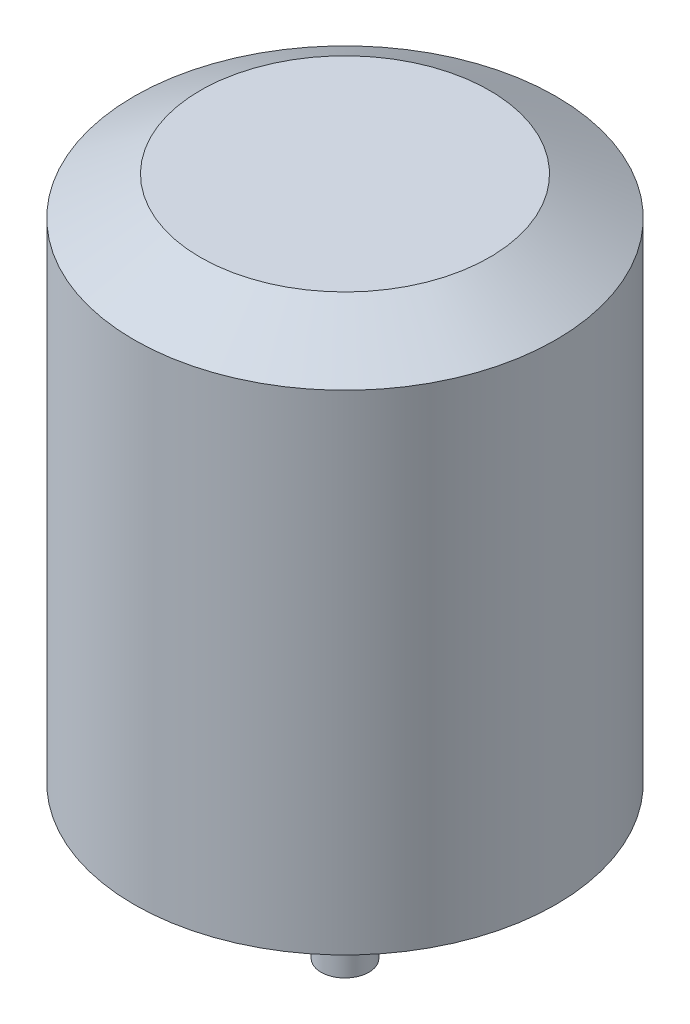
ISO-10303-21;
HEADER;
FILE_DESCRIPTION(('STEP AP214'),'2;1');
FILE_NAME('part.step','',(''),(''),'','','');
FILE_SCHEMA(('AUTOMOTIVE_DESIGN { 1 0 10303 214 1 1 1 1 }'));
ENDSEC;
DATA;
#1=APPLICATION_CONTEXT('core data for automotive mechanical design processes');
#2=APPLICATION_PROTOCOL_DEFINITION('international standard','automotive_design',2000,#1);
#3=PRODUCT_CONTEXT('',#1,'mechanical');
#4=PRODUCT('Part','Part','',(#3));
#5=PRODUCT_RELATED_PRODUCT_CATEGORY('part','',(#4));
#6=PRODUCT_DEFINITION_FORMATION('','',#4);
#7=PRODUCT_DEFINITION_CONTEXT('part definition',#1,'design');
#8=PRODUCT_DEFINITION('design','',#6,#7);
#9=PRODUCT_DEFINITION_SHAPE('','',#8);
#10=(LENGTH_UNIT() NAMED_UNIT(*) SI_UNIT(.MILLI.,.METRE.));
#11=(NAMED_UNIT(*) PLANE_ANGLE_UNIT() SI_UNIT($,.RADIAN.));
#12=(NAMED_UNIT(*) SI_UNIT($,.STERADIAN.) SOLID_ANGLE_UNIT());
#13=UNCERTAINTY_MEASURE_WITH_UNIT(LENGTH_MEASURE(1.E-05),#10,'distance_accuracy_value','');
#14=(GEOMETRIC_REPRESENTATION_CONTEXT(3) GLOBAL_UNCERTAINTY_ASSIGNED_CONTEXT((#13)) GLOBAL_UNIT_ASSIGNED_CONTEXT((#10,
#11,#12)) REPRESENTATION_CONTEXT('',''));
#15=CARTESIAN_POINT('',(0.,0.,0.));
#16=DIRECTION('',(0.,0.,1.));
#17=DIRECTION('',(1.,0.,0.));
#18=AXIS2_PLACEMENT_3D('',#15,#16,#17);
#19=CARTESIAN_POINT('',(0.,17.5,0.));
#20=DIRECTION('',(0.,-1.,0.));
#21=DIRECTION('',(0.,0.,-1.));
#22=AXIS2_PLACEMENT_3D('',#19,#20,#21);
#23=CYLINDRICAL_SURFACE('',#22,14.);
#24=CARTESIAN_POINT('',(0.,14.96,0.));
#25=DIRECTION('',(0.,1.,0.));
#26=DIRECTION('',(0.,0.,1.));
#27=AXIS2_PLACEMENT_3D('',#24,#25,#26);
#28=CIRCLE('',#27,14.);
#29=CARTESIAN_POINT('',(0.,14.96,14.));
#30=VERTEX_POINT('',#29);
#31=EDGE_CURVE('E46',#30,#30,#28,.F.);
#32=ORIENTED_EDGE('',*,*,#31,.T.);
#33=EDGE_LOOP('',(#32));
#34=FACE_BOUND('',#33,.T.);
#35=CARTESIAN_POINT('',(0.,-17.5,0.));
#36=DIRECTION('',(0.,1.,0.));
#37=DIRECTION('',(0.,0.,1.));
#38=AXIS2_PLACEMENT_3D('',#35,#36,#37);
#39=CIRCLE('',#38,14.);
#40=CARTESIAN_POINT('',(0.,-17.5,14.));
#41=VERTEX_POINT('',#40);
#42=EDGE_CURVE('E54',#41,#41,#39,.T.);
#43=ORIENTED_EDGE('',*,*,#42,.T.);
#44=EDGE_LOOP('',(#43));
#45=FACE_BOUND('',#44,.T.);
#46=ADVANCED_FACE('F38',(#34,#45),#23,.T.);
#47=CARTESIAN_POINT('',(0.,17.5,0.));
#48=DIRECTION('',(0.,1.,0.));
#49=DIRECTION('',(0.,0.,1.));
#50=AXIS2_PLACEMENT_3D('',#47,#48,#49);
#51=PLANE('',#50);
#52=CARTESIAN_POINT('',(0.,17.5,0.));
#53=DIRECTION('',(0.,1.,0.));
#54=DIRECTION('',(0.,0.,1.));
#55=AXIS2_PLACEMENT_3D('',#52,#53,#54);
#56=CIRCLE('',#55,9.60059094877507);
#57=CARTESIAN_POINT('',(0.,17.5,9.60059094877507));
#58=VERTEX_POINT('',#57);
#59=EDGE_CURVE('E50',#58,#58,#56,.T.);
#60=ORIENTED_EDGE('',*,*,#59,.T.);
#61=EDGE_LOOP('',(#60));
#62=FACE_BOUND('',#61,.T.);
#63=ADVANCED_FACE('F73',(#62),#51,.T.);
#64=CARTESIAN_POINT('',(0.,-17.5,0.));
#65=DIRECTION('',(0.,1.,0.));
#66=DIRECTION('',(0.,0.,1.));
#67=AXIS2_PLACEMENT_3D('',#64,#65,#66);
#68=PLANE('',#67);
#69=CARTESIAN_POINT('',(0.,-17.5,0.));
#70=DIRECTION('',(0.,1.,0.));
#71=DIRECTION('',(0.,0.,1.));
#72=AXIS2_PLACEMENT_3D('',#69,#70,#71);
#73=CIRCLE('',#72,1.5875);
#74=CARTESIAN_POINT('',(0.,-17.5,1.5875));
#75=VERTEX_POINT('',#74);
#76=EDGE_CURVE('E11',#75,#75,#73,.F.);
#77=ORIENTED_EDGE('',*,*,#76,.F.);
#78=EDGE_LOOP('',(#77));
#79=FACE_BOUND('',#78,.T.);
#80=ORIENTED_EDGE('',*,*,#42,.F.);
#81=EDGE_LOOP('',(#80));
#82=FACE_BOUND('',#81,.T.);
#83=ADVANCED_FACE('F77',(#79,#82),#68,.F.);
#84=CARTESIAN_POINT('',(0.,17.5,0.));
#85=DIRECTION('',(0.,-1.,0.));
#86=DIRECTION('',(0.,0.,-1.));
#87=AXIS2_PLACEMENT_3D('',#84,#85,#86);
#88=CONICAL_SURFACE('',#87,9.60059094877507,1.0471975511966);
#89=ORIENTED_EDGE('',*,*,#31,.F.);
#90=EDGE_LOOP('',(#89));
#91=FACE_BOUND('',#90,.T.);
#92=ORIENTED_EDGE('',*,*,#59,.F.);
#93=EDGE_LOOP('',(#92));
#94=FACE_BOUND('',#93,.T.);
#95=ADVANCED_FACE('F41',(#91,#94),#88,.T.);
#96=CARTESIAN_POINT('',(0.,-77.1901280605346,0.));
#97=DIRECTION('',(0.,1.,0.));
#98=DIRECTION('',(0.,0.,1.));
#99=AXIS2_PLACEMENT_3D('',#96,#97,#98);
#100=CYLINDRICAL_SURFACE('',#99,1.5875);
#101=CARTESIAN_POINT('',(0.,-27.6,0.));
#102=DIRECTION('',(0.,1.,0.));
#103=DIRECTION('',(0.,0.,1.));
#104=AXIS2_PLACEMENT_3D('',#101,#102,#103);
#105=CIRCLE('',#104,1.5875);
#106=CARTESIAN_POINT('',(0.,-27.6,1.5875));
#107=VERTEX_POINT('',#106);
#108=EDGE_CURVE('E59',#107,#107,#105,.T.);
#109=ORIENTED_EDGE('',*,*,#108,.T.);
#110=EDGE_LOOP('',(#109));
#111=FACE_BOUND('',#110,.T.);
#112=ORIENTED_EDGE('',*,*,#76,.T.);
#113=EDGE_LOOP('',(#112));
#114=FACE_BOUND('',#113,.T.);
#115=ADVANCED_FACE('F63',(#111,#114),#100,.T.);
#116=CARTESIAN_POINT('',(0.,-27.6,0.));
#117=DIRECTION('',(0.,1.,0.));
#118=DIRECTION('',(0.,0.,1.));
#119=AXIS2_PLACEMENT_3D('',#116,#117,#118);
#120=PLANE('',#119);
#121=ORIENTED_EDGE('',*,*,#108,.F.);
#122=EDGE_LOOP('',(#121));
#123=FACE_BOUND('',#122,.T.);
#124=ADVANCED_FACE('F65',(#123),#120,.F.);
#125=CLOSED_SHELL('',(#46,#63,#83,#95,#115,#124));
#126=MANIFOLD_SOLID_BREP('B2',#125);
#127=ADVANCED_BREP_SHAPE_REPRESENTATION('',(#18,#126),#14);
#128=SHAPE_DEFINITION_REPRESENTATION(#9,#127);
ENDSEC;
END-ISO-10303-21;
